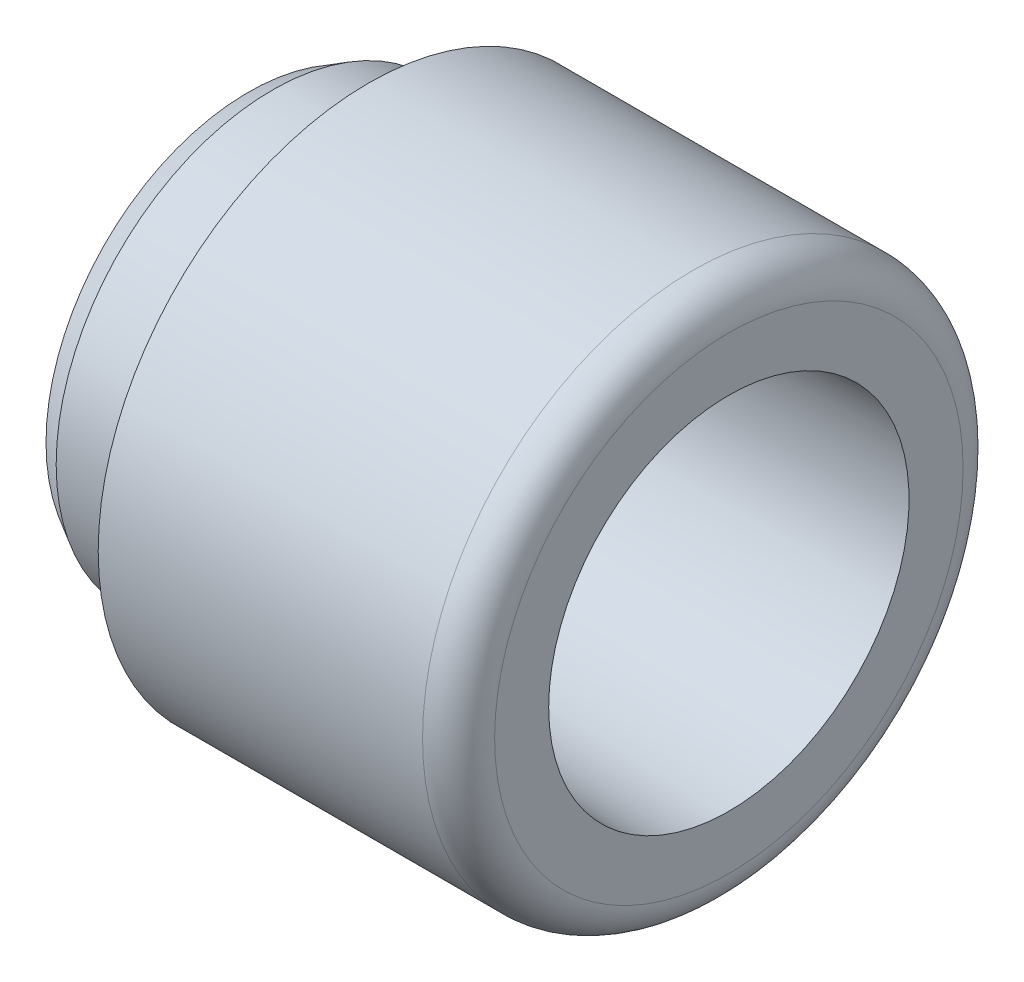
ISO-10303-21;
HEADER;
FILE_DESCRIPTION(('STEP AP214'),'2;1');
FILE_NAME('part.step','',(''),(''),'','','');
FILE_SCHEMA(('AUTOMOTIVE_DESIGN { 1 0 10303 214 1 1 1 1 }'));
ENDSEC;
DATA;
#1=APPLICATION_CONTEXT('core data for automotive mechanical design processes');
#2=APPLICATION_PROTOCOL_DEFINITION('international standard','automotive_design',2000,#1);
#3=PRODUCT_CONTEXT('',#1,'mechanical');
#4=PRODUCT('Part','Part','',(#3));
#5=PRODUCT_RELATED_PRODUCT_CATEGORY('part','',(#4));
#6=PRODUCT_DEFINITION_FORMATION('','',#4);
#7=PRODUCT_DEFINITION_CONTEXT('part definition',#1,'design');
#8=PRODUCT_DEFINITION('design','',#6,#7);
#9=PRODUCT_DEFINITION_SHAPE('','',#8);
#10=(LENGTH_UNIT() NAMED_UNIT(*) SI_UNIT(.MILLI.,.METRE.));
#11=(NAMED_UNIT(*) PLANE_ANGLE_UNIT() SI_UNIT($,.RADIAN.));
#12=(NAMED_UNIT(*) SI_UNIT($,.STERADIAN.) SOLID_ANGLE_UNIT());
#13=UNCERTAINTY_MEASURE_WITH_UNIT(LENGTH_MEASURE(1.E-05),#10,'distance_accuracy_value','');
#14=(GEOMETRIC_REPRESENTATION_CONTEXT(3) GLOBAL_UNCERTAINTY_ASSIGNED_CONTEXT((#13)) GLOBAL_UNIT_ASSIGNED_CONTEXT((#10,
#11,#12)) REPRESENTATION_CONTEXT('',''));
#15=CARTESIAN_POINT('',(0.,0.,0.));
#16=DIRECTION('',(0.,0.,1.));
#17=DIRECTION('',(1.,0.,0.));
#18=AXIS2_PLACEMENT_3D('',#15,#16,#17);
#19=CARTESIAN_POINT('',(12.8,0.,0.));
#20=DIRECTION('',(-1.,0.,0.));
#21=DIRECTION('',(0.,0.,1.));
#22=AXIS2_PLACEMENT_3D('',#19,#20,#21);
#23=TOROIDAL_SURFACE('',#22,13.2496674343854,0.799999999999999);
#24=CARTESIAN_POINT('',(12.772080402638,0.,0.));
#25=DIRECTION('',(-1.,0.,0.));
#26=DIRECTION('',(0.,0.,1.));
#27=AXIS2_PLACEMENT_3D('',#24,#25,#26);
#28=CIRCLE('',#27,14.0491800960007);
#29=CARTESIAN_POINT('',(12.772080402638,0.,14.0491800960007));
#30=VERTEX_POINT('',#29);
#31=EDGE_CURVE('E80',#30,#30,#28,.T.);
#32=ORIENTED_EDGE('',*,*,#31,.F.);
#33=EDGE_LOOP('',(#32));
#34=FACE_BOUND('',#33,.T.);
#35=CARTESIAN_POINT('',(12.,0.,0.));
#36=DIRECTION('',(-1.,0.,0.));
#37=DIRECTION('',(0.,0.,1.));
#38=AXIS2_PLACEMENT_3D('',#35,#36,#37);
#39=CIRCLE('',#38,13.2496674343854);
#40=CARTESIAN_POINT('',(12.,0.,13.2496674343854));
#41=VERTEX_POINT('',#40);
#42=EDGE_CURVE('E10',#41,#41,#39,.T.);
#43=ORIENTED_EDGE('',*,*,#42,.T.);
#44=EDGE_LOOP('',(#43));
#45=FACE_BOUND('',#44,.T.);
#46=ADVANCED_FACE('F43',(#34,#45),#23,.F.);
#47=CARTESIAN_POINT('',(12.,13.2496674343854,0.));
#48=DIRECTION('',(-1.,0.,0.));
#49=DIRECTION('',(0.,0.,1.));
#50=AXIS2_PLACEMENT_3D('',#47,#48,#49);
#51=PLANE('',#50);
#52=ORIENTED_EDGE('',*,*,#42,.F.);
#53=EDGE_LOOP('',(#52));
#54=FACE_BOUND('',#53,.T.);
#55=CARTESIAN_POINT('',(12.,0.,0.));
#56=DIRECTION('',(-1.,0.,0.));
#57=DIRECTION('',(0.,0.,1.));
#58=AXIS2_PLACEMENT_3D('',#55,#56,#57);
#59=CIRCLE('',#58,5.1);
#60=CARTESIAN_POINT('',(12.,0.,5.1));
#61=VERTEX_POINT('',#60);
#62=EDGE_CURVE('E49',#61,#61,#59,.T.);
#63=ORIENTED_EDGE('',*,*,#62,.T.);
#64=EDGE_LOOP('',(#63));
#65=FACE_BOUND('',#64,.T.);
#66=ADVANCED_FACE('F87',(#54,#65),#51,.F.);
#67=CARTESIAN_POINT('',(0.,0.,0.));
#68=DIRECTION('',(-1.,0.,0.));
#69=DIRECTION('',(0.,0.,1.));
#70=AXIS2_PLACEMENT_3D('',#67,#68,#69);
#71=CYLINDRICAL_SURFACE('',#70,5.1);
#72=ORIENTED_EDGE('',*,*,#62,.F.);
#73=EDGE_LOOP('',(#72));
#74=FACE_BOUND('',#73,.T.);
#75=CARTESIAN_POINT('',(0.,0.,0.));
#76=DIRECTION('',(-1.,0.,0.));
#77=DIRECTION('',(0.,0.,1.));
#78=AXIS2_PLACEMENT_3D('',#75,#76,#77);
#79=CIRCLE('',#78,5.1);
#80=CARTESIAN_POINT('',(0.,0.,5.1));
#81=VERTEX_POINT('',#80);
#82=EDGE_CURVE('E53',#81,#81,#79,.T.);
#83=ORIENTED_EDGE('',*,*,#82,.T.);
#84=EDGE_LOOP('',(#83));
#85=FACE_BOUND('',#84,.T.);
#86=ADVANCED_FACE('F91',(#74,#85),#71,.F.);
#87=CARTESIAN_POINT('',(0.,16.8452994616208,0.));
#88=DIRECTION('',(1.,0.,0.));
#89=DIRECTION('',(0.,0.,-1.));
#90=AXIS2_PLACEMENT_3D('',#87,#88,#89);
#91=PLANE('',#90);
#92=ORIENTED_EDGE('',*,*,#82,.F.);
#93=EDGE_LOOP('',(#92));
#94=FACE_BOUND('',#93,.T.);
#95=CARTESIAN_POINT('',(0.,0.,0.));
#96=DIRECTION('',(-1.,0.,0.));
#97=DIRECTION('',(0.,0.,1.));
#98=AXIS2_PLACEMENT_3D('',#95,#96,#97);
#99=CIRCLE('',#98,16.8452994616208);
#100=CARTESIAN_POINT('',(0.,0.,16.8452994616208));
#101=VERTEX_POINT('',#100);
#102=EDGE_CURVE('E57',#101,#101,#99,.T.);
#103=ORIENTED_EDGE('',*,*,#102,.T.);
#104=EDGE_LOOP('',(#103));
#105=FACE_BOUND('',#104,.T.);
#106=ADVANCED_FACE('F97',(#94,#105),#91,.F.);
#107=CARTESIAN_POINT('',(2.,0.,0.));
#108=DIRECTION('',(1.,0.,0.));
#109=DIRECTION('',(0.,0.,-1.));
#110=AXIS2_PLACEMENT_3D('',#107,#108,#109);
#111=CONICAL_SURFACE('',#110,18.,0.523598775598294);
#112=ORIENTED_EDGE('',*,*,#102,.F.);
#113=EDGE_LOOP('',(#112));
#114=FACE_BOUND('',#113,.T.);
#115=CARTESIAN_POINT('',(2.,0.,0.));
#116=DIRECTION('',(-1.,0.,0.));
#117=DIRECTION('',(0.,0.,1.));
#118=AXIS2_PLACEMENT_3D('',#115,#116,#117);
#119=CIRCLE('',#118,18.);
#120=CARTESIAN_POINT('',(2.,0.,18.));
#121=VERTEX_POINT('',#120);
#122=EDGE_CURVE('E62',#121,#121,#119,.T.);
#123=ORIENTED_EDGE('',*,*,#122,.T.);
#124=EDGE_LOOP('',(#123));
#125=FACE_BOUND('',#124,.T.);
#126=ADVANCED_FACE('F103',(#114,#125),#111,.T.);
#127=CARTESIAN_POINT('',(0.,0.,0.));
#128=DIRECTION('',(-1.,0.,0.));
#129=DIRECTION('',(0.,0.,1.));
#130=AXIS2_PLACEMENT_3D('',#127,#128,#129);
#131=CYLINDRICAL_SURFACE('',#130,18.);
#132=ORIENTED_EDGE('',*,*,#122,.F.);
#133=EDGE_LOOP('',(#132));
#134=FACE_BOUND('',#133,.T.);
#135=CARTESIAN_POINT('',(10.,0.,0.));
#136=DIRECTION('',(-1.,0.,0.));
#137=DIRECTION('',(0.,0.,1.));
#138=AXIS2_PLACEMENT_3D('',#135,#136,#137);
#139=CIRCLE('',#138,18.);
#140=CARTESIAN_POINT('',(10.,0.,18.));
#141=VERTEX_POINT('',#140);
#142=EDGE_CURVE('E65',#141,#141,#139,.T.);
#143=ORIENTED_EDGE('',*,*,#142,.T.);
#144=EDGE_LOOP('',(#143));
#145=FACE_BOUND('',#144,.T.);
#146=ADVANCED_FACE('F107',(#134,#145),#131,.T.);
#147=CARTESIAN_POINT('',(10.,22.5,0.));
#148=DIRECTION('',(1.,0.,0.));
#149=DIRECTION('',(0.,0.,-1.));
#150=AXIS2_PLACEMENT_3D('',#147,#148,#149);
#151=PLANE('',#150);
#152=ORIENTED_EDGE('',*,*,#142,.F.);
#153=EDGE_LOOP('',(#152));
#154=FACE_BOUND('',#153,.T.);
#155=CARTESIAN_POINT('',(10.,0.,0.));
#156=DIRECTION('',(-1.,0.,0.));
#157=DIRECTION('',(0.,0.,1.));
#158=AXIS2_PLACEMENT_3D('',#155,#156,#157);
#159=CIRCLE('',#158,22.5);
#160=CARTESIAN_POINT('',(10.,0.,22.5));
#161=VERTEX_POINT('',#160);
#162=EDGE_CURVE('E68',#161,#161,#159,.T.);
#163=ORIENTED_EDGE('',*,*,#162,.T.);
#164=EDGE_LOOP('',(#163));
#165=FACE_BOUND('',#164,.T.);
#166=ADVANCED_FACE('F111',(#154,#165),#151,.F.);
#167=CARTESIAN_POINT('',(0.,0.,0.));
#168=DIRECTION('',(-1.,0.,0.));
#169=DIRECTION('',(0.,0.,1.));
#170=AXIS2_PLACEMENT_3D('',#167,#168,#169);
#171=CYLINDRICAL_SURFACE('',#170,22.5);
#172=ORIENTED_EDGE('',*,*,#162,.F.);
#173=EDGE_LOOP('',(#172));
#174=FACE_BOUND('',#173,.T.);
#175=CARTESIAN_POINT('',(37.,0.,0.));
#176=DIRECTION('',(-1.,0.,0.));
#177=DIRECTION('',(0.,0.,1.));
#178=AXIS2_PLACEMENT_3D('',#175,#176,#177);
#179=CIRCLE('',#178,22.5);
#180=CARTESIAN_POINT('',(37.,0.,22.5));
#181=VERTEX_POINT('',#180);
#182=EDGE_CURVE('E71',#181,#181,#179,.T.);
#183=ORIENTED_EDGE('',*,*,#182,.T.);
#184=EDGE_LOOP('',(#183));
#185=FACE_BOUND('',#184,.T.);
#186=ADVANCED_FACE('F115',(#174,#185),#171,.T.);
#187=CARTESIAN_POINT('',(37.,0.,0.));
#188=DIRECTION('',(-1.,0.,0.));
#189=DIRECTION('',(0.,0.,1.));
#190=AXIS2_PLACEMENT_3D('',#187,#188,#189);
#191=TOROIDAL_SURFACE('',#190,19.5,3.);
#192=ORIENTED_EDGE('',*,*,#182,.F.);
#193=EDGE_LOOP('',(#192));
#194=FACE_BOUND('',#193,.T.);
#195=CARTESIAN_POINT('',(40.,0.,0.));
#196=DIRECTION('',(-1.,0.,0.));
#197=DIRECTION('',(0.,0.,1.));
#198=AXIS2_PLACEMENT_3D('',#195,#196,#197);
#199=CIRCLE('',#198,19.5);
#200=CARTESIAN_POINT('',(40.,0.,19.5));
#201=VERTEX_POINT('',#200);
#202=EDGE_CURVE('E74',#201,#201,#199,.T.);
#203=ORIENTED_EDGE('',*,*,#202,.T.);
#204=EDGE_LOOP('',(#203));
#205=FACE_BOUND('',#204,.T.);
#206=ADVANCED_FACE('F119',(#194,#205),#191,.T.);
#207=CARTESIAN_POINT('',(40.,15.,0.));
#208=DIRECTION('',(-1.,0.,0.));
#209=DIRECTION('',(0.,0.,1.));
#210=AXIS2_PLACEMENT_3D('',#207,#208,#209);
#211=PLANE('',#210);
#212=ORIENTED_EDGE('',*,*,#202,.F.);
#213=EDGE_LOOP('',(#212));
#214=FACE_BOUND('',#213,.T.);
#215=CARTESIAN_POINT('',(40.,0.,0.));
#216=DIRECTION('',(-1.,0.,0.));
#217=DIRECTION('',(0.,0.,1.));
#218=AXIS2_PLACEMENT_3D('',#215,#216,#217);
#219=CIRCLE('',#218,15.);
#220=CARTESIAN_POINT('',(40.,0.,15.));
#221=VERTEX_POINT('',#220);
#222=EDGE_CURVE('E77',#221,#221,#219,.T.);
#223=ORIENTED_EDGE('',*,*,#222,.T.);
#224=EDGE_LOOP('',(#223));
#225=FACE_BOUND('',#224,.T.);
#226=ADVANCED_FACE('F123',(#214,#225),#211,.F.);
#227=CARTESIAN_POINT('',(12.772080402638,0.,0.));
#228=DIRECTION('',(1.,0.,0.));
#229=DIRECTION('',(0.,0.,-1.));
#230=AXIS2_PLACEMENT_3D('',#227,#228,#229);
#231=CONICAL_SURFACE('',#230,14.0491800960007,0.0349065850398873);
#232=ORIENTED_EDGE('',*,*,#222,.F.);
#233=EDGE_LOOP('',(#232));
#234=FACE_BOUND('',#233,.T.);
#235=ORIENTED_EDGE('',*,*,#31,.T.);
#236=EDGE_LOOP('',(#235));
#237=FACE_BOUND('',#236,.T.);
#238=ADVANCED_FACE('F84',(#234,#237),#231,.F.);
#239=CLOSED_SHELL('',(#46,#66,#86,#106,#126,#146,#166,#186,#206,#226,#238));
#240=MANIFOLD_SOLID_BREP('B2',#239);
#241=ADVANCED_BREP_SHAPE_REPRESENTATION('',(#18,#240),#14);
#242=SHAPE_DEFINITION_REPRESENTATION(#9,#241);
ENDSEC;
END-ISO-10303-21;
